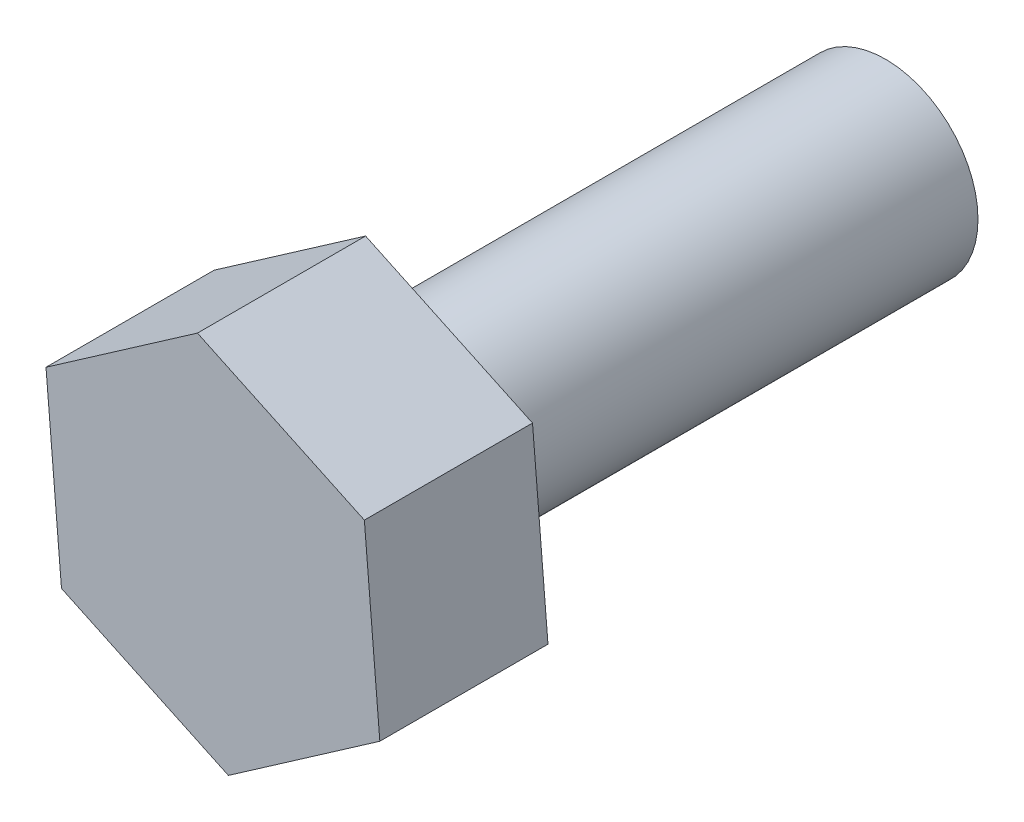
ISO-10303-21;
HEADER;
FILE_DESCRIPTION(('STEP AP214'),'2;1');
FILE_NAME('part.step','',(''),(''),'','','');
FILE_SCHEMA(('AUTOMOTIVE_DESIGN { 1 0 10303 214 1 1 1 1 }'));
ENDSEC;
DATA;
#1=APPLICATION_CONTEXT('core data for automotive mechanical design processes');
#2=APPLICATION_PROTOCOL_DEFINITION('international standard','automotive_design',2000,#1);
#3=PRODUCT_CONTEXT('',#1,'mechanical');
#4=PRODUCT('Part','Part','',(#3));
#5=PRODUCT_RELATED_PRODUCT_CATEGORY('part','',(#4));
#6=PRODUCT_DEFINITION_FORMATION('','',#4);
#7=PRODUCT_DEFINITION_CONTEXT('part definition',#1,'design');
#8=PRODUCT_DEFINITION('design','',#6,#7);
#9=PRODUCT_DEFINITION_SHAPE('','',#8);
#10=(LENGTH_UNIT() NAMED_UNIT(*) SI_UNIT(.MILLI.,.METRE.));
#11=(NAMED_UNIT(*) PLANE_ANGLE_UNIT() SI_UNIT($,.RADIAN.));
#12=(NAMED_UNIT(*) SI_UNIT($,.STERADIAN.) SOLID_ANGLE_UNIT());
#13=UNCERTAINTY_MEASURE_WITH_UNIT(LENGTH_MEASURE(1.E-05),#10,'distance_accuracy_value','');
#14=(GEOMETRIC_REPRESENTATION_CONTEXT(3) GLOBAL_UNCERTAINTY_ASSIGNED_CONTEXT((#13)) GLOBAL_UNIT_ASSIGNED_CONTEXT((#10,
#11,#12)) REPRESENTATION_CONTEXT('',''));
#15=CARTESIAN_POINT('',(0.,0.,0.));
#16=DIRECTION('',(0.,0.,1.));
#17=DIRECTION('',(1.,0.,0.));
#18=AXIS2_PLACEMENT_3D('',#15,#16,#17);
#19=CARTESIAN_POINT('',(0.,0.,30.));
#20=DIRECTION('',(0.,0.,-1.));
#21=DIRECTION('',(-1.,0.,0.));
#22=AXIS2_PLACEMENT_3D('',#19,#20,#21);
#23=CYLINDRICAL_SURFACE('',#22,5.5);
#24=CARTESIAN_POINT('',(0.,0.,30.));
#25=DIRECTION('',(0.,0.,1.));
#26=DIRECTION('',(1.,0.,0.));
#27=AXIS2_PLACEMENT_3D('',#24,#25,#26);
#28=CIRCLE('',#27,5.5);
#29=CARTESIAN_POINT('',(5.5,0.,30.));
#30=VERTEX_POINT('',#29);
#31=EDGE_CURVE('E11',#30,#30,#28,.T.);
#32=ORIENTED_EDGE('',*,*,#31,.F.);
#33=EDGE_LOOP('',(#32));
#34=FACE_BOUND('',#33,.T.);
#35=CARTESIAN_POINT('',(0.,0.,0.));
#36=DIRECTION('',(0.,0.,1.));
#37=DIRECTION('',(1.,0.,0.));
#38=AXIS2_PLACEMENT_3D('',#35,#36,#37);
#39=CIRCLE('',#38,5.5);
#40=CARTESIAN_POINT('',(5.5,0.,0.));
#41=VERTEX_POINT('',#40);
#42=EDGE_CURVE('E36',#41,#41,#39,.T.);
#43=ORIENTED_EDGE('',*,*,#42,.T.);
#44=EDGE_LOOP('',(#43));
#45=FACE_BOUND('',#44,.T.);
#46=ADVANCED_FACE('F33',(#34,#45),#23,.T.);
#47=CARTESIAN_POINT('',(0.,0.,0.));
#48=DIRECTION('',(0.,0.,1.));
#49=DIRECTION('',(1.,0.,0.));
#50=AXIS2_PLACEMENT_3D('',#47,#48,#49);
#51=PLANE('',#50);
#52=ORIENTED_EDGE('',*,*,#42,.F.);
#53=EDGE_LOOP('',(#52));
#54=FACE_BOUND('',#53,.T.);
#55=ADVANCED_FACE('F141',(#54),#51,.F.);
#56=CARTESIAN_POINT('',(0.,0.,30.));
#57=DIRECTION('',(0.,0.,1.));
#58=DIRECTION('',(1.,0.,0.));
#59=AXIS2_PLACEMENT_3D('',#56,#57,#58);
#60=PLANE('',#59);
#61=DIRECTION('',(-0.821031535491542,-0.570882840632297,0.));
#62=VECTOR('',#61,1.);
#63=CARTESIAN_POINT('',(-0.920170594729297,10.9309935234602,30.));
#64=LINE('',#63,#62);
#65=CARTESIAN_POINT('',(-0.920170594729297,10.9309935234602,30.));
#66=VERTEX_POINT('',#65);
#67=CARTESIAN_POINT('',(-9.92660337728435,4.66860565087909,30.));
#68=VERTEX_POINT('',#67);
#69=EDGE_CURVE('E118',#66,#68,#64,.T.);
#70=ORIENTED_EDGE('',*,*,#69,.F.);
#71=DIRECTION('',(-0.904914810317964,0.425592746727672,0.));
#72=VECTOR('',#71,1.);
#73=CARTESIAN_POINT('',(9.00643278255506,6.2623878725811,30.));
#74=LINE('',#73,#72);
#75=CARTESIAN_POINT('',(9.00643278255506,6.2623878725811,30.));
#76=VERTEX_POINT('',#75);
#77=EDGE_CURVE('E78',#76,#66,#74,.T.);
#78=ORIENTED_EDGE('',*,*,#77,.F.);
#79=DIRECTION('',(-0.0838832748264218,0.996475587359969,0.));
#80=VECTOR('',#79,1.);
#81=CARTESIAN_POINT('',(9.92660337728435,-4.66860565087909,30.));
#82=LINE('',#81,#80);
#83=CARTESIAN_POINT('',(9.92660337728435,-4.66860565087909,30.));
#84=VERTEX_POINT('',#83);
#85=EDGE_CURVE('E72',#84,#76,#82,.T.);
#86=ORIENTED_EDGE('',*,*,#85,.F.);
#87=DIRECTION('',(0.821031535491542,0.570882840632297,0.));
#88=VECTOR('',#87,1.);
#89=CARTESIAN_POINT('',(0.920170594729296,-10.9309935234602,30.));
#90=LINE('',#89,#88);
#91=CARTESIAN_POINT('',(0.920170594729296,-10.9309935234602,30.));
#92=VERTEX_POINT('',#91);
#93=EDGE_CURVE('E108',#92,#84,#90,.T.);
#94=ORIENTED_EDGE('',*,*,#93,.F.);
#95=DIRECTION('',(0.904914810317963,-0.425592746727672,0.));
#96=VECTOR('',#95,1.);
#97=CARTESIAN_POINT('',(-9.00643278255506,-6.2623878725811,30.));
#98=LINE('',#97,#96);
#99=CARTESIAN_POINT('',(-9.00643278255506,-6.2623878725811,30.));
#100=VERTEX_POINT('',#99);
#101=EDGE_CURVE('E123',#100,#92,#98,.T.);
#102=ORIENTED_EDGE('',*,*,#101,.F.);
#103=DIRECTION('',(0.0838832748264216,-0.996475587359969,0.));
#104=VECTOR('',#103,1.);
#105=CARTESIAN_POINT('',(-9.92660337728435,4.66860565087909,30.));
#106=LINE('',#105,#104);
#107=EDGE_CURVE('E121',#68,#100,#106,.T.);
#108=ORIENTED_EDGE('',*,*,#107,.F.);
#109=EDGE_LOOP('',(#70,#78,#86,#94,#102,#108));
#110=FACE_BOUND('',#109,.T.);
#111=ORIENTED_EDGE('',*,*,#31,.T.);
#112=EDGE_LOOP('',(#111));
#113=FACE_BOUND('',#112,.T.);
#114=ADVANCED_FACE('F143',(#110,#113),#60,.F.);
#115=CARTESIAN_POINT('',(-0.920170594729297,10.9309935234602,40.));
#116=DIRECTION('',(0.570882840632297,-0.821031535491542,0.));
#117=DIRECTION('',(0.821031535491542,0.570882840632297,0.));
#118=AXIS2_PLACEMENT_3D('',#115,#116,#117);
#119=PLANE('',#118);
#120=ORIENTED_EDGE('',*,*,#69,.T.);
#121=DIRECTION('',(0.,0.,-1.));
#122=VECTOR('',#121,1.);
#123=CARTESIAN_POINT('',(-9.92660337728435,4.66860565087909,40.));
#124=LINE('',#123,#122);
#125=CARTESIAN_POINT('',(-9.92660337728435,4.66860565087909,40.));
#126=VERTEX_POINT('',#125);
#127=EDGE_CURVE('E135',#126,#68,#124,.T.);
#128=ORIENTED_EDGE('',*,*,#127,.F.);
#129=DIRECTION('',(-0.821031535491542,-0.570882840632297,0.));
#130=VECTOR('',#129,1.);
#131=CARTESIAN_POINT('',(-0.920170594729297,10.9309935234602,40.));
#132=LINE('',#131,#130);
#133=CARTESIAN_POINT('',(-0.920170594729297,10.9309935234602,40.));
#134=VERTEX_POINT('',#133);
#135=EDGE_CURVE('E128',#134,#126,#132,.T.);
#136=ORIENTED_EDGE('',*,*,#135,.F.);
#137=DIRECTION('',(0.,0.,-1.));
#138=VECTOR('',#137,1.);
#139=CARTESIAN_POINT('',(-0.920170594729297,10.9309935234602,40.));
#140=LINE('',#139,#138);
#141=EDGE_CURVE('E114',#134,#66,#140,.T.);
#142=ORIENTED_EDGE('',*,*,#141,.T.);
#143=EDGE_LOOP('',(#120,#128,#136,#142));
#144=FACE_BOUND('',#143,.T.);
#145=ADVANCED_FACE('F148',(#144),#119,.F.);
#146=CARTESIAN_POINT('',(-9.92660337728435,4.66860565087909,40.));
#147=DIRECTION('',(0.996475587359969,0.0838832748264216,0.));
#148=DIRECTION('',(-0.0838832748264216,0.996475587359969,0.));
#149=AXIS2_PLACEMENT_3D('',#146,#147,#148);
#150=PLANE('',#149);
#151=ORIENTED_EDGE('',*,*,#107,.T.);
#152=DIRECTION('',(0.,0.,-1.));
#153=VECTOR('',#152,1.);
#154=CARTESIAN_POINT('',(-9.00643278255506,-6.2623878725811,40.));
#155=LINE('',#154,#153);
#156=CARTESIAN_POINT('',(-9.00643278255506,-6.2623878725811,40.));
#157=VERTEX_POINT('',#156);
#158=EDGE_CURVE('E132',#157,#100,#155,.T.);
#159=ORIENTED_EDGE('',*,*,#158,.F.);
#160=DIRECTION('',(0.0838832748264216,-0.996475587359969,0.));
#161=VECTOR('',#160,1.);
#162=CARTESIAN_POINT('',(-9.92660337728435,4.66860565087909,40.));
#163=LINE('',#162,#161);
#164=EDGE_CURVE('E87',#126,#157,#163,.T.);
#165=ORIENTED_EDGE('',*,*,#164,.F.);
#166=ORIENTED_EDGE('',*,*,#127,.T.);
#167=EDGE_LOOP('',(#151,#159,#165,#166));
#168=FACE_BOUND('',#167,.T.);
#169=ADVANCED_FACE('F155',(#168),#150,.F.);
#170=CARTESIAN_POINT('',(-9.00643278255506,-6.2623878725811,40.));
#171=DIRECTION('',(0.425592746727672,0.904914810317964,0.));
#172=DIRECTION('',(-0.904914810317964,0.425592746727672,0.));
#173=AXIS2_PLACEMENT_3D('',#170,#171,#172);
#174=PLANE('',#173);
#175=ORIENTED_EDGE('',*,*,#101,.T.);
#176=DIRECTION('',(0.,0.,-1.));
#177=VECTOR('',#176,1.);
#178=CARTESIAN_POINT('',(0.920170594729296,-10.9309935234602,40.));
#179=LINE('',#178,#177);
#180=CARTESIAN_POINT('',(0.920170594729296,-10.9309935234602,40.));
#181=VERTEX_POINT('',#180);
#182=EDGE_CURVE('E109',#181,#92,#179,.T.);
#183=ORIENTED_EDGE('',*,*,#182,.F.);
#184=DIRECTION('',(0.904914810317963,-0.425592746727672,0.));
#185=VECTOR('',#184,1.);
#186=CARTESIAN_POINT('',(-9.00643278255506,-6.2623878725811,40.));
#187=LINE('',#186,#185);
#188=EDGE_CURVE('E100',#157,#181,#187,.T.);
#189=ORIENTED_EDGE('',*,*,#188,.F.);
#190=ORIENTED_EDGE('',*,*,#158,.T.);
#191=EDGE_LOOP('',(#175,#183,#189,#190));
#192=FACE_BOUND('',#191,.T.);
#193=ADVANCED_FACE('F159',(#192),#174,.F.);
#194=CARTESIAN_POINT('',(0.920170594729296,-10.9309935234602,40.));
#195=DIRECTION('',(-0.570882840632297,0.821031535491542,0.));
#196=DIRECTION('',(-0.821031535491542,-0.570882840632297,0.));
#197=AXIS2_PLACEMENT_3D('',#194,#195,#196);
#198=PLANE('',#197);
#199=ORIENTED_EDGE('',*,*,#93,.T.);
#200=DIRECTION('',(0.,0.,-1.));
#201=VECTOR('',#200,1.);
#202=CARTESIAN_POINT('',(9.92660337728435,-4.66860565087909,40.));
#203=LINE('',#202,#201);
#204=CARTESIAN_POINT('',(9.92660337728435,-4.66860565087909,40.));
#205=VERTEX_POINT('',#204);
#206=EDGE_CURVE('E105',#205,#84,#203,.T.);
#207=ORIENTED_EDGE('',*,*,#206,.F.);
#208=DIRECTION('',(0.821031535491542,0.570882840632297,0.));
#209=VECTOR('',#208,1.);
#210=CARTESIAN_POINT('',(0.920170594729296,-10.9309935234602,40.));
#211=LINE('',#210,#209);
#212=EDGE_CURVE('E94',#181,#205,#211,.T.);
#213=ORIENTED_EDGE('',*,*,#212,.F.);
#214=ORIENTED_EDGE('',*,*,#182,.T.);
#215=EDGE_LOOP('',(#199,#207,#213,#214));
#216=FACE_BOUND('',#215,.T.);
#217=ADVANCED_FACE('F106',(#216),#198,.F.);
#218=CARTESIAN_POINT('',(9.92660337728435,-4.66860565087909,40.));
#219=DIRECTION('',(-0.996475587359969,-0.0838832748264218,0.));
#220=DIRECTION('',(0.0838832748264218,-0.996475587359969,0.));
#221=AXIS2_PLACEMENT_3D('',#218,#219,#220);
#222=PLANE('',#221);
#223=ORIENTED_EDGE('',*,*,#85,.T.);
#224=DIRECTION('',(0.,0.,-1.));
#225=VECTOR('',#224,1.);
#226=CARTESIAN_POINT('',(9.00643278255506,6.2623878725811,40.));
#227=LINE('',#226,#225);
#228=CARTESIAN_POINT('',(9.00643278255506,6.2623878725811,40.));
#229=VERTEX_POINT('',#228);
#230=EDGE_CURVE('E110',#229,#76,#227,.T.);
#231=ORIENTED_EDGE('',*,*,#230,.F.);
#232=DIRECTION('',(-0.0838832748264218,0.996475587359969,0.));
#233=VECTOR('',#232,1.);
#234=CARTESIAN_POINT('',(9.92660337728435,-4.66860565087909,40.));
#235=LINE('',#234,#233);
#236=EDGE_CURVE('E98',#205,#229,#235,.T.);
#237=ORIENTED_EDGE('',*,*,#236,.F.);
#238=ORIENTED_EDGE('',*,*,#206,.T.);
#239=EDGE_LOOP('',(#223,#231,#237,#238));
#240=FACE_BOUND('',#239,.T.);
#241=ADVANCED_FACE('F112',(#240),#222,.F.);
#242=CARTESIAN_POINT('',(9.00643278255506,6.2623878725811,40.));
#243=DIRECTION('',(-0.425592746727672,-0.904914810317964,0.));
#244=DIRECTION('',(0.904914810317964,-0.425592746727672,0.));
#245=AXIS2_PLACEMENT_3D('',#242,#243,#244);
#246=PLANE('',#245);
#247=ORIENTED_EDGE('',*,*,#77,.T.);
#248=ORIENTED_EDGE('',*,*,#141,.F.);
#249=DIRECTION('',(-0.904914810317964,0.425592746727672,0.));
#250=VECTOR('',#249,1.);
#251=CARTESIAN_POINT('',(9.00643278255506,6.2623878725811,40.));
#252=LINE('',#251,#250);
#253=EDGE_CURVE('E49',#229,#134,#252,.T.);
#254=ORIENTED_EDGE('',*,*,#253,.F.);
#255=ORIENTED_EDGE('',*,*,#230,.T.);
#256=EDGE_LOOP('',(#247,#248,#254,#255));
#257=FACE_BOUND('',#256,.T.);
#258=ADVANCED_FACE('F167',(#257),#246,.F.);
#259=CARTESIAN_POINT('',(0.,0.,40.));
#260=DIRECTION('',(0.,0.,1.));
#261=DIRECTION('',(1.,0.,0.));
#262=AXIS2_PLACEMENT_3D('',#259,#260,#261);
#263=PLANE('',#262);
#264=ORIENTED_EDGE('',*,*,#135,.T.);
#265=ORIENTED_EDGE('',*,*,#164,.T.);
#266=ORIENTED_EDGE('',*,*,#188,.T.);
#267=ORIENTED_EDGE('',*,*,#212,.T.);
#268=ORIENTED_EDGE('',*,*,#236,.T.);
#269=ORIENTED_EDGE('',*,*,#253,.T.);
#270=EDGE_LOOP('',(#264,#265,#266,#267,#268,#269));
#271=FACE_BOUND('',#270,.T.);
#272=ADVANCED_FACE('F96',(#271),#263,.T.);
#273=CLOSED_SHELL('',(#46,#55,#114,#145,#169,#193,#217,#241,#258,#272));
#274=MANIFOLD_SOLID_BREP('B2',#273);
#275=ADVANCED_BREP_SHAPE_REPRESENTATION('',(#18,#274),#14);
#276=SHAPE_DEFINITION_REPRESENTATION(#9,#275);
ENDSEC;
END-ISO-10303-21;
